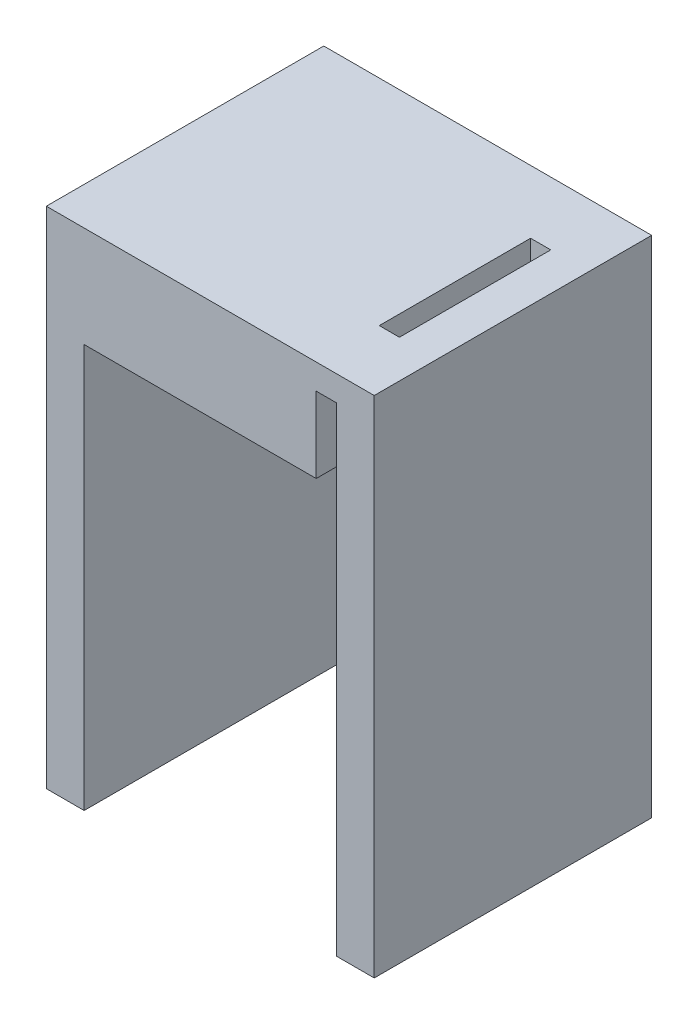
ISO-10303-21;
HEADER;
FILE_DESCRIPTION(('STEP AP214'),'2;1');
FILE_NAME('part.step','',(''),(''),'','','');
FILE_SCHEMA(('AUTOMOTIVE_DESIGN { 1 0 10303 214 1 1 1 1 }'));
ENDSEC;
DATA;
#1=APPLICATION_CONTEXT('core data for automotive mechanical design processes');
#2=APPLICATION_PROTOCOL_DEFINITION('international standard','automotive_design',2000,#1);
#3=PRODUCT_CONTEXT('',#1,'mechanical');
#4=PRODUCT('Part','Part','',(#3));
#5=PRODUCT_RELATED_PRODUCT_CATEGORY('part','',(#4));
#6=PRODUCT_DEFINITION_FORMATION('','',#4);
#7=PRODUCT_DEFINITION_CONTEXT('part definition',#1,'design');
#8=PRODUCT_DEFINITION('design','',#6,#7);
#9=PRODUCT_DEFINITION_SHAPE('','',#8);
#10=(LENGTH_UNIT() NAMED_UNIT(*) SI_UNIT(.MILLI.,.METRE.));
#11=(NAMED_UNIT(*) PLANE_ANGLE_UNIT() SI_UNIT($,.RADIAN.));
#12=(NAMED_UNIT(*) SI_UNIT($,.STERADIAN.) SOLID_ANGLE_UNIT());
#13=UNCERTAINTY_MEASURE_WITH_UNIT(LENGTH_MEASURE(1.E-05),#10,'distance_accuracy_value','');
#14=(GEOMETRIC_REPRESENTATION_CONTEXT(3) GLOBAL_UNCERTAINTY_ASSIGNED_CONTEXT((#13)) GLOBAL_UNIT_ASSIGNED_CONTEXT((#10,
#11,#12)) REPRESENTATION_CONTEXT('',''));
#15=CARTESIAN_POINT('',(0.,0.,0.));
#16=DIRECTION('',(0.,0.,1.));
#17=DIRECTION('',(1.,0.,0.));
#18=AXIS2_PLACEMENT_3D('',#15,#16,#17);
#19=CARTESIAN_POINT('',(0.,24.13,-13.97));
#20=DIRECTION('',(0.,1.,0.));
#21=DIRECTION('',(0.,0.,1.));
#22=AXIS2_PLACEMENT_3D('',#19,#20,#21);
#23=PLANE('',#22);
#24=DIRECTION('',(0.,0.,1.));
#25=VECTOR('',#24,1.);
#26=CARTESIAN_POINT('',(-1.016,24.13,-13.97));
#27=LINE('',#26,#25);
#28=CARTESIAN_POINT('',(-1.016,24.13,-3.175));
#29=VERTEX_POINT('',#28);
#30=CARTESIAN_POINT('',(-1.016,24.13,0.));
#31=VERTEX_POINT('',#30);
#32=EDGE_CURVE('E211',#29,#31,#27,.T.);
#33=ORIENTED_EDGE('',*,*,#32,.F.);
#34=DIRECTION('',(-1.,0.,0.));
#35=VECTOR('',#34,1.);
#36=CARTESIAN_POINT('',(-1.016,24.13,-3.175));
#37=LINE('',#36,#35);
#38=CARTESIAN_POINT('',(0.,24.13,-3.175));
#39=VERTEX_POINT('',#38);
#40=EDGE_CURVE('E167',#39,#29,#37,.T.);
#41=ORIENTED_EDGE('',*,*,#40,.F.);
#42=DIRECTION('',(0.,0.,1.));
#43=VECTOR('',#42,1.);
#44=CARTESIAN_POINT('',(0.,24.13,-13.97));
#45=LINE('',#44,#43);
#46=CARTESIAN_POINT('',(0.,24.13,0.));
#47=VERTEX_POINT('',#46);
#48=EDGE_CURVE('E198',#39,#47,#45,.T.);
#49=ORIENTED_EDGE('',*,*,#48,.T.);
#50=DIRECTION('',(-1.,0.,0.));
#51=VECTOR('',#50,1.);
#52=CARTESIAN_POINT('',(0.,24.13,0.));
#53=LINE('',#52,#51);
#54=EDGE_CURVE('E183',#47,#31,#53,.T.);
#55=ORIENTED_EDGE('',*,*,#54,.T.);
#56=EDGE_LOOP('',(#33,#41,#49,#55));
#57=FACE_BOUND('',#56,.T.);
#58=ADVANCED_FACE('F43',(#57),#23,.F.);
#59=CARTESIAN_POINT('',(1.905,0.,-13.97));
#60=DIRECTION('',(0.,-1.,0.));
#61=DIRECTION('',(1.,0.,0.));
#62=AXIS2_PLACEMENT_3D('',#59,#60,#61);
#63=PLANE('',#62);
#64=DIRECTION('',(1.,0.,0.));
#65=VECTOR('',#64,1.);
#66=CARTESIAN_POINT('',(1.905,0.,0.));
#67=LINE('',#66,#65);
#68=CARTESIAN_POINT('',(0.,0.,0.));
#69=VERTEX_POINT('',#68);
#70=CARTESIAN_POINT('',(1.905,0.,0.));
#71=VERTEX_POINT('',#70);
#72=EDGE_CURVE('E208',#69,#71,#67,.T.);
#73=ORIENTED_EDGE('',*,*,#72,.F.);
#74=DIRECTION('',(0.,0.,1.));
#75=VECTOR('',#74,1.);
#76=CARTESIAN_POINT('',(0.,0.,-13.97));
#77=LINE('',#76,#75);
#78=CARTESIAN_POINT('',(0.,0.,-13.97));
#79=VERTEX_POINT('',#78);
#80=EDGE_CURVE('E11',#79,#69,#77,.T.);
#81=ORIENTED_EDGE('',*,*,#80,.F.);
#82=DIRECTION('',(1.,0.,0.));
#83=VECTOR('',#82,1.);
#84=CARTESIAN_POINT('',(1.905,0.,-13.97));
#85=LINE('',#84,#83);
#86=CARTESIAN_POINT('',(1.905,0.,-13.97));
#87=VERTEX_POINT('',#86);
#88=EDGE_CURVE('E216',#79,#87,#85,.T.);
#89=ORIENTED_EDGE('',*,*,#88,.T.);
#90=DIRECTION('',(0.,0.,1.));
#91=VECTOR('',#90,1.);
#92=CARTESIAN_POINT('',(1.905,0.,-13.97));
#93=LINE('',#92,#91);
#94=EDGE_CURVE('E47',#87,#71,#93,.T.);
#95=ORIENTED_EDGE('',*,*,#94,.T.);
#96=EDGE_LOOP('',(#73,#81,#89,#95));
#97=FACE_BOUND('',#96,.T.);
#98=ADVANCED_FACE('F45',(#97),#63,.T.);
#99=CARTESIAN_POINT('',(0.,0.,-13.97));
#100=DIRECTION('',(-1.,0.,0.));
#101=DIRECTION('',(0.,0.,1.));
#102=AXIS2_PLACEMENT_3D('',#99,#100,#101);
#103=PLANE('',#102);
#104=DIRECTION('',(0.,-1.,0.));
#105=VECTOR('',#104,1.);
#106=CARTESIAN_POINT('',(0.,0.,0.));
#107=LINE('',#106,#105);
#108=EDGE_CURVE('E221',#47,#69,#107,.T.);
#109=ORIENTED_EDGE('',*,*,#108,.F.);
#110=ORIENTED_EDGE('',*,*,#48,.F.);
#111=DIRECTION('',(0.,-1.,0.));
#112=VECTOR('',#111,1.);
#113=CARTESIAN_POINT('',(0.,25.4,-3.175));
#114=LINE('',#113,#112);
#115=CARTESIAN_POINT('',(0.,25.4,-3.175));
#116=VERTEX_POINT('',#115);
#117=EDGE_CURVE('E184',#116,#39,#114,.T.);
#118=ORIENTED_EDGE('',*,*,#117,.F.);
#119=DIRECTION('',(0.,0.,1.));
#120=VECTOR('',#119,1.);
#121=CARTESIAN_POINT('',(0.,25.4,-3.175));
#122=LINE('',#121,#120);
#123=CARTESIAN_POINT('',(0.,25.4,-10.795));
#124=VERTEX_POINT('',#123);
#125=EDGE_CURVE('E61',#124,#116,#122,.T.);
#126=ORIENTED_EDGE('',*,*,#125,.F.);
#127=DIRECTION('',(0.,-1.,0.));
#128=VECTOR('',#127,1.);
#129=CARTESIAN_POINT('',(0.,25.4,-10.795));
#130=LINE('',#129,#128);
#131=CARTESIAN_POINT('',(0.,24.13,-10.795));
#132=VERTEX_POINT('',#131);
#133=EDGE_CURVE('E153',#124,#132,#130,.T.);
#134=ORIENTED_EDGE('',*,*,#133,.T.);
#135=CARTESIAN_POINT('',(0.,24.13,-13.97));
#136=VERTEX_POINT('',#135);
#137=EDGE_CURVE('E212',#136,#132,#45,.T.);
#138=ORIENTED_EDGE('',*,*,#137,.F.);
#139=DIRECTION('',(0.,-1.,0.));
#140=VECTOR('',#139,1.);
#141=CARTESIAN_POINT('',(0.,0.,-13.97));
#142=LINE('',#141,#140);
#143=EDGE_CURVE('E243',#136,#79,#142,.T.);
#144=ORIENTED_EDGE('',*,*,#143,.T.);
#145=ORIENTED_EDGE('',*,*,#80,.T.);
#146=EDGE_LOOP('',(#109,#110,#118,#126,#134,#138,#144,#145));
#147=FACE_BOUND('',#146,.T.);
#148=ADVANCED_FACE('F305',(#147),#103,.T.);
#149=CARTESIAN_POINT('',(0.,20.32,-13.97));
#150=DIRECTION('',(0.,-1.,0.));
#151=DIRECTION('',(0.,0.,-1.));
#152=AXIS2_PLACEMENT_3D('',#149,#150,#151);
#153=PLANE('',#152);
#154=DIRECTION('',(0.,0.,1.));
#155=VECTOR('',#154,1.);
#156=CARTESIAN_POINT('',(-1.016,20.32,-13.97));
#157=LINE('',#156,#155);
#158=CARTESIAN_POINT('',(-1.016,20.32,-13.97));
#159=VERTEX_POINT('',#158);
#160=CARTESIAN_POINT('',(-1.016,20.32,0.));
#161=VERTEX_POINT('',#160);
#162=EDGE_CURVE('E204',#159,#161,#157,.T.);
#163=ORIENTED_EDGE('',*,*,#162,.T.);
#164=DIRECTION('',(1.,0.,0.));
#165=VECTOR('',#164,1.);
#166=CARTESIAN_POINT('',(0.,20.32,0.));
#167=LINE('',#166,#165);
#168=CARTESIAN_POINT('',(-12.7,20.32,0.));
#169=VERTEX_POINT('',#168);
#170=EDGE_CURVE('E270',#169,#161,#167,.T.);
#171=ORIENTED_EDGE('',*,*,#170,.F.);
#172=DIRECTION('',(0.,0.,1.));
#173=VECTOR('',#172,1.);
#174=CARTESIAN_POINT('',(-12.7,20.32,-13.97));
#175=LINE('',#174,#173);
#176=CARTESIAN_POINT('',(-12.7,20.32,-13.97));
#177=VERTEX_POINT('',#176);
#178=EDGE_CURVE('E53',#177,#169,#175,.T.);
#179=ORIENTED_EDGE('',*,*,#178,.F.);
#180=DIRECTION('',(1.,0.,0.));
#181=VECTOR('',#180,1.);
#182=CARTESIAN_POINT('',(0.,20.32,-13.97));
#183=LINE('',#182,#181);
#184=EDGE_CURVE('E239',#177,#159,#183,.T.);
#185=ORIENTED_EDGE('',*,*,#184,.T.);
#186=EDGE_LOOP('',(#163,#171,#179,#185));
#187=FACE_BOUND('',#186,.T.);
#188=ADVANCED_FACE('F325',(#187),#153,.T.);
#189=CARTESIAN_POINT('',(-12.7,20.32,-13.97));
#190=DIRECTION('',(1.,0.,0.));
#191=DIRECTION('',(0.,1.,0.));
#192=AXIS2_PLACEMENT_3D('',#189,#190,#191);
#193=PLANE('',#192);
#194=DIRECTION('',(0.,1.,0.));
#195=VECTOR('',#194,1.);
#196=CARTESIAN_POINT('',(-12.7,20.32,0.));
#197=LINE('',#196,#195);
#198=CARTESIAN_POINT('',(-12.7,0.,0.));
#199=VERTEX_POINT('',#198);
#200=EDGE_CURVE('E266',#199,#169,#197,.T.);
#201=ORIENTED_EDGE('',*,*,#200,.F.);
#202=DIRECTION('',(0.,0.,1.));
#203=VECTOR('',#202,1.);
#204=CARTESIAN_POINT('',(-12.7,0.,-13.97));
#205=LINE('',#204,#203);
#206=CARTESIAN_POINT('',(-12.7,0.,-13.97));
#207=VERTEX_POINT('',#206);
#208=EDGE_CURVE('E279',#207,#199,#205,.T.);
#209=ORIENTED_EDGE('',*,*,#208,.F.);
#210=DIRECTION('',(0.,1.,0.));
#211=VECTOR('',#210,1.);
#212=CARTESIAN_POINT('',(-12.7,20.32,-13.97));
#213=LINE('',#212,#211);
#214=EDGE_CURVE('E235',#207,#177,#213,.T.);
#215=ORIENTED_EDGE('',*,*,#214,.T.);
#216=ORIENTED_EDGE('',*,*,#178,.T.);
#217=EDGE_LOOP('',(#201,#209,#215,#216));
#218=FACE_BOUND('',#217,.T.);
#219=ADVANCED_FACE('F322',(#218),#193,.T.);
#220=CARTESIAN_POINT('',(-12.7,0.,-13.97));
#221=DIRECTION('',(0.,-1.,0.));
#222=DIRECTION('',(1.,0.,0.));
#223=AXIS2_PLACEMENT_3D('',#220,#221,#222);
#224=PLANE('',#223);
#225=DIRECTION('',(1.,0.,0.));
#226=VECTOR('',#225,1.);
#227=CARTESIAN_POINT('',(-12.7,0.,0.));
#228=LINE('',#227,#226);
#229=CARTESIAN_POINT('',(-14.605,0.,0.));
#230=VERTEX_POINT('',#229);
#231=EDGE_CURVE('E262',#230,#199,#228,.T.);
#232=ORIENTED_EDGE('',*,*,#231,.F.);
#233=DIRECTION('',(0.,0.,1.));
#234=VECTOR('',#233,1.);
#235=CARTESIAN_POINT('',(-14.605,0.,-13.97));
#236=LINE('',#235,#234);
#237=CARTESIAN_POINT('',(-14.605,0.,-13.97));
#238=VERTEX_POINT('',#237);
#239=EDGE_CURVE('E282',#238,#230,#236,.T.);
#240=ORIENTED_EDGE('',*,*,#239,.F.);
#241=DIRECTION('',(1.,0.,0.));
#242=VECTOR('',#241,1.);
#243=CARTESIAN_POINT('',(-12.7,0.,-13.97));
#244=LINE('',#243,#242);
#245=EDGE_CURVE('E231',#238,#207,#244,.T.);
#246=ORIENTED_EDGE('',*,*,#245,.T.);
#247=ORIENTED_EDGE('',*,*,#208,.T.);
#248=EDGE_LOOP('',(#232,#240,#246,#247));
#249=FACE_BOUND('',#248,.T.);
#250=ADVANCED_FACE('F318',(#249),#224,.T.);
#251=CARTESIAN_POINT('',(-14.605,0.,-13.97));
#252=DIRECTION('',(-1.,0.,0.));
#253=DIRECTION('',(0.,0.,1.));
#254=AXIS2_PLACEMENT_3D('',#251,#252,#253);
#255=PLANE('',#254);
#256=DIRECTION('',(0.,-1.,0.));
#257=VECTOR('',#256,1.);
#258=CARTESIAN_POINT('',(-14.605,0.,0.));
#259=LINE('',#258,#257);
#260=CARTESIAN_POINT('',(-14.605,25.4,0.));
#261=VERTEX_POINT('',#260);
#262=EDGE_CURVE('E258',#261,#230,#259,.T.);
#263=ORIENTED_EDGE('',*,*,#262,.F.);
#264=DIRECTION('',(0.,0.,1.));
#265=VECTOR('',#264,1.);
#266=CARTESIAN_POINT('',(-14.605,25.4,-13.97));
#267=LINE('',#266,#265);
#268=CARTESIAN_POINT('',(-14.605,25.4,-13.97));
#269=VERTEX_POINT('',#268);
#270=EDGE_CURVE('E285',#269,#261,#267,.T.);
#271=ORIENTED_EDGE('',*,*,#270,.F.);
#272=DIRECTION('',(0.,-1.,0.));
#273=VECTOR('',#272,1.);
#274=CARTESIAN_POINT('',(-14.605,19.05,-13.97));
#275=LINE('',#274,#273);
#276=EDGE_CURVE('E228',#269,#238,#275,.T.);
#277=ORIENTED_EDGE('',*,*,#276,.T.);
#278=ORIENTED_EDGE('',*,*,#239,.T.);
#279=EDGE_LOOP('',(#263,#271,#277,#278));
#280=FACE_BOUND('',#279,.T.);
#281=ADVANCED_FACE('F314',(#280),#255,.T.);
#282=CARTESIAN_POINT('',(-14.605,25.4,-13.97));
#283=DIRECTION('',(0.,1.,0.));
#284=DIRECTION('',(0.,0.,1.));
#285=AXIS2_PLACEMENT_3D('',#282,#283,#284);
#286=PLANE('',#285);
#287=DIRECTION('',(0.,0.,-1.));
#288=VECTOR('',#287,1.);
#289=CARTESIAN_POINT('',(-1.016,25.4,-10.795));
#290=LINE('',#289,#288);
#291=CARTESIAN_POINT('',(-1.016,25.4,-3.175));
#292=VERTEX_POINT('',#291);
#293=CARTESIAN_POINT('',(-1.016,25.4,-10.795));
#294=VERTEX_POINT('',#293);
#295=EDGE_CURVE('E148',#292,#294,#290,.T.);
#296=ORIENTED_EDGE('',*,*,#295,.T.);
#297=DIRECTION('',(1.,0.,0.));
#298=VECTOR('',#297,1.);
#299=CARTESIAN_POINT('',(0.,25.4,-10.795));
#300=LINE('',#299,#298);
#301=EDGE_CURVE('E157',#294,#124,#300,.T.);
#302=ORIENTED_EDGE('',*,*,#301,.T.);
#303=ORIENTED_EDGE('',*,*,#125,.T.);
#304=DIRECTION('',(-1.,0.,0.));
#305=VECTOR('',#304,1.);
#306=CARTESIAN_POINT('',(-1.016,25.4,-3.175));
#307=LINE('',#306,#305);
#308=EDGE_CURVE('E154',#116,#292,#307,.T.);
#309=ORIENTED_EDGE('',*,*,#308,.T.);
#310=EDGE_LOOP('',(#296,#302,#303,#309));
#311=FACE_BOUND('',#310,.T.);
#312=DIRECTION('',(-1.,0.,0.));
#313=VECTOR('',#312,1.);
#314=CARTESIAN_POINT('',(-14.605,25.4,0.));
#315=LINE('',#314,#313);
#316=CARTESIAN_POINT('',(1.905,25.4,0.));
#317=VERTEX_POINT('',#316);
#318=EDGE_CURVE('E254',#317,#261,#315,.T.);
#319=ORIENTED_EDGE('',*,*,#318,.F.);
#320=DIRECTION('',(0.,0.,1.));
#321=VECTOR('',#320,1.);
#322=CARTESIAN_POINT('',(1.905,25.4,-13.97));
#323=LINE('',#322,#321);
#324=CARTESIAN_POINT('',(1.905,25.4,-13.97));
#325=VERTEX_POINT('',#324);
#326=EDGE_CURVE('E288',#325,#317,#323,.T.);
#327=ORIENTED_EDGE('',*,*,#326,.F.);
#328=DIRECTION('',(-1.,0.,0.));
#329=VECTOR('',#328,1.);
#330=CARTESIAN_POINT('',(-14.605,25.4,-13.97));
#331=LINE('',#330,#329);
#332=EDGE_CURVE('E224',#325,#269,#331,.T.);
#333=ORIENTED_EDGE('',*,*,#332,.T.);
#334=ORIENTED_EDGE('',*,*,#270,.T.);
#335=EDGE_LOOP('',(#319,#327,#333,#334));
#336=FACE_BOUND('',#335,.T.);
#337=ADVANCED_FACE('F163',(#311,#336),#286,.T.);
#338=CARTESIAN_POINT('',(1.905,25.4,-13.97));
#339=DIRECTION('',(1.,0.,0.));
#340=DIRECTION('',(0.,1.,0.));
#341=AXIS2_PLACEMENT_3D('',#338,#339,#340);
#342=PLANE('',#341);
#343=DIRECTION('',(0.,1.,0.));
#344=VECTOR('',#343,1.);
#345=CARTESIAN_POINT('',(1.905,25.4,0.));
#346=LINE('',#345,#344);
#347=EDGE_CURVE('E250',#71,#317,#346,.T.);
#348=ORIENTED_EDGE('',*,*,#347,.F.);
#349=ORIENTED_EDGE('',*,*,#94,.F.);
#350=DIRECTION('',(0.,1.,0.));
#351=VECTOR('',#350,1.);
#352=CARTESIAN_POINT('',(1.905,19.05,-13.97));
#353=LINE('',#352,#351);
#354=EDGE_CURVE('E220',#87,#325,#353,.T.);
#355=ORIENTED_EDGE('',*,*,#354,.T.);
#356=ORIENTED_EDGE('',*,*,#326,.T.);
#357=EDGE_LOOP('',(#348,#349,#355,#356));
#358=FACE_BOUND('',#357,.T.);
#359=ADVANCED_FACE('F311',(#358),#342,.T.);
#360=CARTESIAN_POINT('',(0.,0.,-13.97));
#361=DIRECTION('',(0.,0.,-1.));
#362=DIRECTION('',(-1.,0.,0.));
#363=AXIS2_PLACEMENT_3D('',#360,#361,#362);
#364=PLANE('',#363);
#365=DIRECTION('',(0.,-1.,0.));
#366=VECTOR('',#365,1.);
#367=CARTESIAN_POINT('',(-1.016,24.13,-13.97));
#368=LINE('',#367,#366);
#369=CARTESIAN_POINT('',(-1.016,24.13,-13.97));
#370=VERTEX_POINT('',#369);
#371=EDGE_CURVE('E193',#370,#159,#368,.T.);
#372=ORIENTED_EDGE('',*,*,#371,.T.);
#373=ORIENTED_EDGE('',*,*,#184,.F.);
#374=ORIENTED_EDGE('',*,*,#214,.F.);
#375=ORIENTED_EDGE('',*,*,#245,.F.);
#376=ORIENTED_EDGE('',*,*,#276,.F.);
#377=ORIENTED_EDGE('',*,*,#332,.F.);
#378=ORIENTED_EDGE('',*,*,#354,.F.);
#379=ORIENTED_EDGE('',*,*,#88,.F.);
#380=ORIENTED_EDGE('',*,*,#143,.F.);
#381=DIRECTION('',(-1.,0.,0.));
#382=VECTOR('',#381,1.);
#383=CARTESIAN_POINT('',(0.,24.13,-13.97));
#384=LINE('',#383,#382);
#385=EDGE_CURVE('E189',#136,#370,#384,.T.);
#386=ORIENTED_EDGE('',*,*,#385,.T.);
#387=EDGE_LOOP('',(#372,#373,#374,#375,#376,#377,#378,#379,#380,#386));
#388=FACE_BOUND('',#387,.T.);
#389=ADVANCED_FACE('F308',(#388),#364,.T.);
#390=CARTESIAN_POINT('',(0.,0.,0.));
#391=DIRECTION('',(0.,0.,-1.));
#392=DIRECTION('',(-1.,0.,0.));
#393=AXIS2_PLACEMENT_3D('',#390,#391,#392);
#394=PLANE('',#393);
#395=ORIENTED_EDGE('',*,*,#170,.T.);
#396=DIRECTION('',(0.,-1.,0.));
#397=VECTOR('',#396,1.);
#398=CARTESIAN_POINT('',(-1.016,24.13,0.));
#399=LINE('',#398,#397);
#400=EDGE_CURVE('E194',#31,#161,#399,.T.);
#401=ORIENTED_EDGE('',*,*,#400,.F.);
#402=ORIENTED_EDGE('',*,*,#54,.F.);
#403=ORIENTED_EDGE('',*,*,#108,.T.);
#404=ORIENTED_EDGE('',*,*,#72,.T.);
#405=ORIENTED_EDGE('',*,*,#347,.T.);
#406=ORIENTED_EDGE('',*,*,#318,.T.);
#407=ORIENTED_EDGE('',*,*,#262,.T.);
#408=ORIENTED_EDGE('',*,*,#231,.T.);
#409=ORIENTED_EDGE('',*,*,#200,.T.);
#410=EDGE_LOOP('',(#395,#401,#402,#403,#404,#405,#406,#407,#408,#409));
#411=FACE_BOUND('',#410,.T.);
#412=ADVANCED_FACE('F300',(#411),#394,.F.);
#413=CARTESIAN_POINT('',(-1.016,24.13,-13.97));
#414=DIRECTION('',(-1.,0.,0.));
#415=DIRECTION('',(0.,-1.,0.));
#416=AXIS2_PLACEMENT_3D('',#413,#414,#415);
#417=PLANE('',#416);
#418=ORIENTED_EDGE('',*,*,#400,.T.);
#419=ORIENTED_EDGE('',*,*,#162,.F.);
#420=ORIENTED_EDGE('',*,*,#371,.F.);
#421=CARTESIAN_POINT('',(-1.016,24.13,-10.795));
#422=VERTEX_POINT('',#421);
#423=EDGE_CURVE('E151',#370,#422,#27,.T.);
#424=ORIENTED_EDGE('',*,*,#423,.T.);
#425=DIRECTION('',(0.,-1.,0.));
#426=VECTOR('',#425,1.);
#427=CARTESIAN_POINT('',(-1.016,25.4,-10.795));
#428=LINE('',#427,#426);
#429=EDGE_CURVE('E69',#294,#422,#428,.T.);
#430=ORIENTED_EDGE('',*,*,#429,.F.);
#431=ORIENTED_EDGE('',*,*,#295,.F.);
#432=DIRECTION('',(0.,-1.,0.));
#433=VECTOR('',#432,1.);
#434=CARTESIAN_POINT('',(-1.016,25.4,-3.175));
#435=LINE('',#434,#433);
#436=EDGE_CURVE('E180',#292,#29,#435,.T.);
#437=ORIENTED_EDGE('',*,*,#436,.T.);
#438=ORIENTED_EDGE('',*,*,#32,.T.);
#439=EDGE_LOOP('',(#418,#419,#420,#424,#430,#431,#437,#438));
#440=FACE_BOUND('',#439,.T.);
#441=ADVANCED_FACE('F146',(#440),#417,.F.);
#442=ORIENTED_EDGE('',*,*,#137,.T.);
#443=DIRECTION('',(1.,0.,0.));
#444=VECTOR('',#443,1.);
#445=CARTESIAN_POINT('',(0.,24.13,-10.795));
#446=LINE('',#445,#444);
#447=EDGE_CURVE('E171',#422,#132,#446,.T.);
#448=ORIENTED_EDGE('',*,*,#447,.F.);
#449=ORIENTED_EDGE('',*,*,#423,.F.);
#450=ORIENTED_EDGE('',*,*,#385,.F.);
#451=EDGE_LOOP('',(#442,#448,#449,#450));
#452=FACE_BOUND('',#451,.T.);
#453=ADVANCED_FACE('F329',(#452),#23,.F.);
#454=CARTESIAN_POINT('',(-1.016,25.4,-3.175));
#455=DIRECTION('',(0.,0.,1.));
#456=DIRECTION('',(1.,0.,0.));
#457=AXIS2_PLACEMENT_3D('',#454,#455,#456);
#458=PLANE('',#457);
#459=ORIENTED_EDGE('',*,*,#40,.T.);
#460=ORIENTED_EDGE('',*,*,#436,.F.);
#461=ORIENTED_EDGE('',*,*,#308,.F.);
#462=ORIENTED_EDGE('',*,*,#117,.T.);
#463=EDGE_LOOP('',(#459,#460,#461,#462));
#464=FACE_BOUND('',#463,.T.);
#465=ADVANCED_FACE('F331',(#464),#458,.F.);
#466=CARTESIAN_POINT('',(0.,25.4,-10.795));
#467=DIRECTION('',(0.,0.,-1.));
#468=DIRECTION('',(-1.,0.,0.));
#469=AXIS2_PLACEMENT_3D('',#466,#467,#468);
#470=PLANE('',#469);
#471=ORIENTED_EDGE('',*,*,#447,.T.);
#472=ORIENTED_EDGE('',*,*,#133,.F.);
#473=ORIENTED_EDGE('',*,*,#301,.F.);
#474=ORIENTED_EDGE('',*,*,#429,.T.);
#475=EDGE_LOOP('',(#471,#472,#473,#474));
#476=FACE_BOUND('',#475,.T.);
#477=ADVANCED_FACE('F158',(#476),#470,.F.);
#478=CLOSED_SHELL('',(#58,#98,#148,#188,#219,#250,#281,#337,#359,#389,#412,#441,#453,#465,#477));
#479=MANIFOLD_SOLID_BREP('B2',#478);
#480=ADVANCED_BREP_SHAPE_REPRESENTATION('',(#18,#479),#14);
#481=SHAPE_DEFINITION_REPRESENTATION(#9,#480);
ENDSEC;
END-ISO-10303-21;
